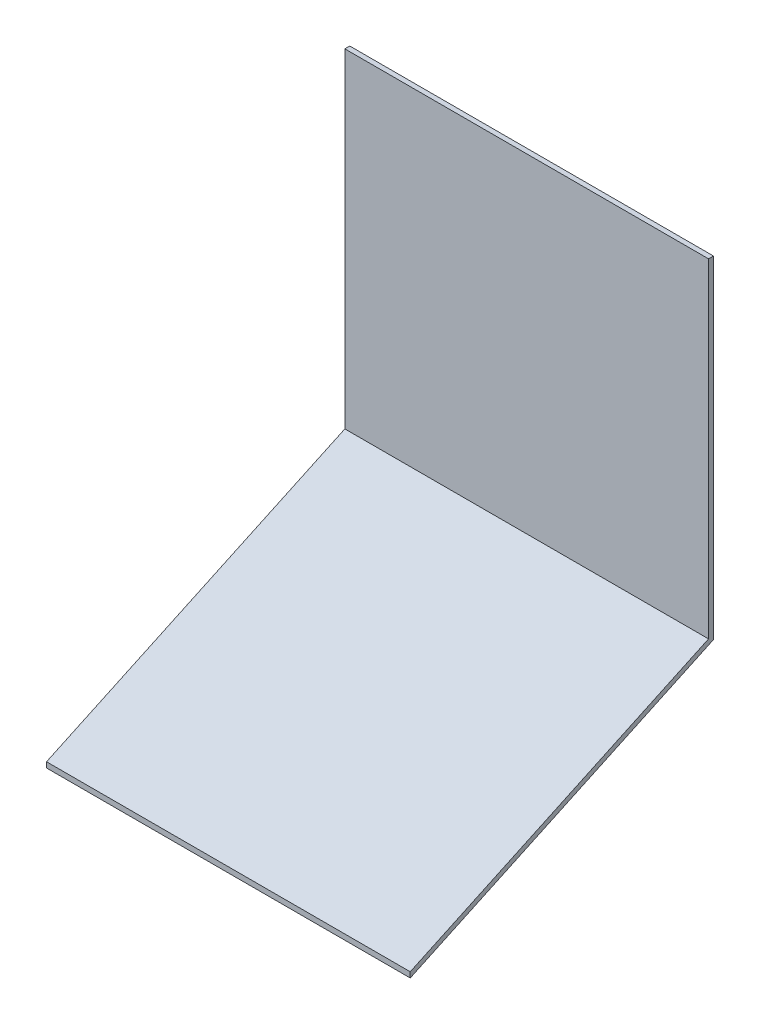
ISO-10303-21;
HEADER;
FILE_DESCRIPTION(('STEP AP214'),'2;1');
FILE_NAME('part.step','',(''),(''),'','','');
FILE_SCHEMA(('AUTOMOTIVE_DESIGN { 1 0 10303 214 1 1 1 1 }'));
ENDSEC;
DATA;
#1=APPLICATION_CONTEXT('core data for automotive mechanical design processes');
#2=APPLICATION_PROTOCOL_DEFINITION('international standard','automotive_design',2000,#1);
#3=PRODUCT_CONTEXT('',#1,'mechanical');
#4=PRODUCT('Part','Part','',(#3));
#5=PRODUCT_RELATED_PRODUCT_CATEGORY('part','',(#4));
#6=PRODUCT_DEFINITION_FORMATION('','',#4);
#7=PRODUCT_DEFINITION_CONTEXT('part definition',#1,'design');
#8=PRODUCT_DEFINITION('design','',#6,#7);
#9=PRODUCT_DEFINITION_SHAPE('','',#8);
#10=(LENGTH_UNIT() NAMED_UNIT(*) SI_UNIT(.MILLI.,.METRE.));
#11=(NAMED_UNIT(*) PLANE_ANGLE_UNIT() SI_UNIT($,.RADIAN.));
#12=(NAMED_UNIT(*) SI_UNIT($,.STERADIAN.) SOLID_ANGLE_UNIT());
#13=UNCERTAINTY_MEASURE_WITH_UNIT(LENGTH_MEASURE(1.E-05),#10,'distance_accuracy_value','');
#14=(GEOMETRIC_REPRESENTATION_CONTEXT(3) GLOBAL_UNCERTAINTY_ASSIGNED_CONTEXT((#13)) GLOBAL_UNIT_ASSIGNED_CONTEXT((#10,
#11,#12)) REPRESENTATION_CONTEXT('',''));
#15=CARTESIAN_POINT('',(0.,0.,0.));
#16=DIRECTION('',(0.,0.,1.));
#17=DIRECTION('',(1.,0.,0.));
#18=AXIS2_PLACEMENT_3D('',#15,#16,#17);
#19=CARTESIAN_POINT('',(112.268,-1.67594278867052,0.));
#20=DIRECTION('',(0.,0.,-1.));
#21=DIRECTION('',(0.,1.,0.));
#22=AXIS2_PLACEMENT_3D('',#19,#20,#21);
#23=PLANE('',#22);
#24=DIRECTION('',(0.,-1.,0.));
#25=VECTOR('',#24,1.);
#26=CARTESIAN_POINT('',(0.,-1.67594278867052,0.));
#27=LINE('',#26,#25);
#28=CARTESIAN_POINT('',(0.,0.,0.));
#29=VERTEX_POINT('',#28);
#30=CARTESIAN_POINT('',(0.,-1.67594278867052,0.));
#31=VERTEX_POINT('',#30);
#32=EDGE_CURVE('E127',#29,#31,#27,.T.);
#33=ORIENTED_EDGE('',*,*,#32,.T.);
#34=DIRECTION('',(-1.,0.,0.));
#35=VECTOR('',#34,1.);
#36=CARTESIAN_POINT('',(112.268,-1.67594278867052,0.));
#37=LINE('',#36,#35);
#38=CARTESIAN_POINT('',(112.268,-1.67594278867052,0.));
#39=VERTEX_POINT('',#38);
#40=EDGE_CURVE('E11',#39,#31,#37,.T.);
#41=ORIENTED_EDGE('',*,*,#40,.F.);
#42=DIRECTION('',(0.,-1.,0.));
#43=VECTOR('',#42,1.);
#44=CARTESIAN_POINT('',(112.268,-1.67594278867052,0.));
#45=LINE('',#44,#43);
#46=CARTESIAN_POINT('',(112.268,0.,0.));
#47=VERTEX_POINT('',#46);
#48=EDGE_CURVE('E143',#47,#39,#45,.T.);
#49=ORIENTED_EDGE('',*,*,#48,.F.);
#50=DIRECTION('',(-1.,0.,0.));
#51=VECTOR('',#50,1.);
#52=CARTESIAN_POINT('',(112.268,0.,0.));
#53=LINE('',#52,#51);
#54=EDGE_CURVE('E123',#47,#29,#53,.T.);
#55=ORIENTED_EDGE('',*,*,#54,.T.);
#56=EDGE_LOOP('',(#33,#41,#49,#55));
#57=FACE_BOUND('',#56,.T.);
#58=ADVANCED_FACE('F38',(#57),#23,.F.);
#59=CARTESIAN_POINT('',(112.268,41.9703566323091,-93.5997911629238));
#60=DIRECTION('',(0.,0.906307787036651,0.422618261740697));
#61=DIRECTION('',(0.,-0.422618261740697,0.906307787036651));
#62=AXIS2_PLACEMENT_3D('',#59,#60,#61);
#63=PLANE('',#62);
#64=DIRECTION('',(0.,0.422618261740697,-0.906307787036651));
#65=VECTOR('',#64,1.);
#66=CARTESIAN_POINT('',(0.,41.9703566323091,-93.5997911629238));
#67=LINE('',#66,#65);
#68=CARTESIAN_POINT('',(0.,41.9703566323091,-93.5997911629238));
#69=VERTEX_POINT('',#68);
#70=EDGE_CURVE('E131',#31,#69,#67,.T.);
#71=ORIENTED_EDGE('',*,*,#70,.T.);
#72=DIRECTION('',(-1.,0.,0.));
#73=VECTOR('',#72,1.);
#74=CARTESIAN_POINT('',(112.268,41.9703566323091,-93.5997911629238));
#75=LINE('',#74,#73);
#76=CARTESIAN_POINT('',(112.268,41.9703566323091,-93.5997911629238));
#77=VERTEX_POINT('',#76);
#78=EDGE_CURVE('E47',#77,#69,#75,.T.);
#79=ORIENTED_EDGE('',*,*,#78,.F.);
#80=DIRECTION('',(0.,0.422618261740697,-0.906307787036651));
#81=VECTOR('',#80,1.);
#82=CARTESIAN_POINT('',(112.268,41.9703566323091,-93.5997911629238));
#83=LINE('',#82,#81);
#84=EDGE_CURVE('E92',#39,#77,#83,.T.);
#85=ORIENTED_EDGE('',*,*,#84,.F.);
#86=ORIENTED_EDGE('',*,*,#40,.T.);
#87=EDGE_LOOP('',(#71,#79,#85,#86));
#88=FACE_BOUND('',#87,.T.);
#89=ADVANCED_FACE('F171',(#88),#63,.F.);
#90=CARTESIAN_POINT('',(112.268,144.538015392855,-93.5997911629237));
#91=DIRECTION('',(0.,0.,1.));
#92=DIRECTION('',(0.,-1.,0.));
#93=AXIS2_PLACEMENT_3D('',#90,#91,#92);
#94=PLANE('',#93);
#95=DIRECTION('',(0.,1.,0.));
#96=VECTOR('',#95,1.);
#97=CARTESIAN_POINT('',(0.,144.538015392855,-93.5997911629237));
#98=LINE('',#97,#96);
#99=CARTESIAN_POINT('',(0.,144.538015392855,-93.5997911629237));
#100=VERTEX_POINT('',#99);
#101=EDGE_CURVE('E134',#69,#100,#98,.T.);
#102=ORIENTED_EDGE('',*,*,#101,.T.);
#103=DIRECTION('',(-1.,0.,0.));
#104=VECTOR('',#103,1.);
#105=CARTESIAN_POINT('',(112.268,144.538015392855,-93.5997911629237));
#106=LINE('',#105,#104);
#107=CARTESIAN_POINT('',(112.268,144.538015392855,-93.5997911629237));
#108=VERTEX_POINT('',#107);
#109=EDGE_CURVE('E116',#108,#100,#106,.T.);
#110=ORIENTED_EDGE('',*,*,#109,.F.);
#111=DIRECTION('',(0.,1.,0.));
#112=VECTOR('',#111,1.);
#113=CARTESIAN_POINT('',(112.268,144.538015392855,-93.5997911629237));
#114=LINE('',#113,#112);
#115=EDGE_CURVE('E105',#77,#108,#114,.T.);
#116=ORIENTED_EDGE('',*,*,#115,.F.);
#117=ORIENTED_EDGE('',*,*,#78,.T.);
#118=EDGE_LOOP('',(#102,#110,#116,#117));
#119=FACE_BOUND('',#118,.T.);
#120=ADVANCED_FACE('F153',(#119),#94,.F.);
#121=CARTESIAN_POINT('',(112.268,144.538015392855,-92.0808711629237));
#122=DIRECTION('',(0.,-1.,0.));
#123=DIRECTION('',(0.,0.,-1.));
#124=AXIS2_PLACEMENT_3D('',#121,#122,#123);
#125=PLANE('',#124);
#126=DIRECTION('',(0.,0.,1.));
#127=VECTOR('',#126,1.);
#128=CARTESIAN_POINT('',(0.,144.538015392855,-92.0808711629237));
#129=LINE('',#128,#127);
#130=CARTESIAN_POINT('',(0.,144.538015392855,-92.0808711629237));
#131=VERTEX_POINT('',#130);
#132=EDGE_CURVE('E114',#100,#131,#129,.T.);
#133=ORIENTED_EDGE('',*,*,#132,.T.);
#134=DIRECTION('',(-1.,0.,0.));
#135=VECTOR('',#134,1.);
#136=CARTESIAN_POINT('',(112.268,144.538015392855,-92.0808711629237));
#137=LINE('',#136,#135);
#138=CARTESIAN_POINT('',(112.268,144.538015392855,-92.0808711629237));
#139=VERTEX_POINT('',#138);
#140=EDGE_CURVE('E111',#139,#131,#137,.T.);
#141=ORIENTED_EDGE('',*,*,#140,.F.);
#142=DIRECTION('',(0.,0.,1.));
#143=VECTOR('',#142,1.);
#144=CARTESIAN_POINT('',(112.268,144.538015392855,-92.0808711629237));
#145=LINE('',#144,#143);
#146=EDGE_CURVE('E99',#108,#139,#145,.T.);
#147=ORIENTED_EDGE('',*,*,#146,.F.);
#148=ORIENTED_EDGE('',*,*,#109,.T.);
#149=EDGE_LOOP('',(#133,#141,#147,#148));
#150=FACE_BOUND('',#149,.T.);
#151=ADVANCED_FACE('F112',(#150),#125,.F.);
#152=CARTESIAN_POINT('',(112.268,42.9380153928548,-92.0808711629237));
#153=DIRECTION('',(0.,0.,-1.));
#154=DIRECTION('',(0.,1.,0.));
#155=AXIS2_PLACEMENT_3D('',#152,#153,#154);
#156=PLANE('',#155);
#157=DIRECTION('',(0.,-1.,0.));
#158=VECTOR('',#157,1.);
#159=CARTESIAN_POINT('',(0.,42.9380153928548,-92.0808711629237));
#160=LINE('',#159,#158);
#161=CARTESIAN_POINT('',(0.,42.9380153928548,-92.0808711629237));
#162=VERTEX_POINT('',#161);
#163=EDGE_CURVE('E78',#131,#162,#160,.T.);
#164=ORIENTED_EDGE('',*,*,#163,.T.);
#165=DIRECTION('',(-1.,0.,0.));
#166=VECTOR('',#165,1.);
#167=CARTESIAN_POINT('',(112.268,42.9380153928548,-92.0808711629237));
#168=LINE('',#167,#166);
#169=CARTESIAN_POINT('',(112.268,42.9380153928548,-92.0808711629237));
#170=VERTEX_POINT('',#169);
#171=EDGE_CURVE('E117',#170,#162,#168,.T.);
#172=ORIENTED_EDGE('',*,*,#171,.F.);
#173=DIRECTION('',(0.,-1.,0.));
#174=VECTOR('',#173,1.);
#175=CARTESIAN_POINT('',(112.268,42.9380153928548,-92.0808711629237));
#176=LINE('',#175,#174);
#177=EDGE_CURVE('E103',#139,#170,#176,.T.);
#178=ORIENTED_EDGE('',*,*,#177,.F.);
#179=ORIENTED_EDGE('',*,*,#140,.T.);
#180=EDGE_LOOP('',(#164,#172,#178,#179));
#181=FACE_BOUND('',#180,.T.);
#182=ADVANCED_FACE('F119',(#181),#156,.F.);
#183=CARTESIAN_POINT('',(112.268,0.,0.));
#184=DIRECTION('',(0.,-0.906307787036651,-0.422618261740697));
#185=DIRECTION('',(0.,0.422618261740697,-0.906307787036651));
#186=AXIS2_PLACEMENT_3D('',#183,#184,#185);
#187=PLANE('',#186);
#188=DIRECTION('',(0.,-0.422618261740697,0.906307787036651));
#189=VECTOR('',#188,1.);
#190=CARTESIAN_POINT('',(0.,0.,0.));
#191=LINE('',#190,#189);
#192=EDGE_CURVE('E84',#162,#29,#191,.T.);
#193=ORIENTED_EDGE('',*,*,#192,.T.);
#194=ORIENTED_EDGE('',*,*,#54,.F.);
#195=DIRECTION('',(0.,-0.422618261740697,0.906307787036651));
#196=VECTOR('',#195,1.);
#197=CARTESIAN_POINT('',(112.268,0.,0.));
#198=LINE('',#197,#196);
#199=EDGE_CURVE('E55',#170,#47,#198,.T.);
#200=ORIENTED_EDGE('',*,*,#199,.F.);
#201=ORIENTED_EDGE('',*,*,#171,.T.);
#202=EDGE_LOOP('',(#193,#194,#200,#201));
#203=FACE_BOUND('',#202,.T.);
#204=ADVANCED_FACE('F160',(#203),#187,.F.);
#205=CARTESIAN_POINT('',(112.268,0.,0.));
#206=DIRECTION('',(-1.,0.,0.));
#207=DIRECTION('',(0.,0.,1.));
#208=AXIS2_PLACEMENT_3D('',#205,#206,#207);
#209=PLANE('',#208);
#210=ORIENTED_EDGE('',*,*,#48,.T.);
#211=ORIENTED_EDGE('',*,*,#84,.T.);
#212=ORIENTED_EDGE('',*,*,#115,.T.);
#213=ORIENTED_EDGE('',*,*,#146,.T.);
#214=ORIENTED_EDGE('',*,*,#177,.T.);
#215=ORIENTED_EDGE('',*,*,#199,.T.);
#216=EDGE_LOOP('',(#210,#211,#212,#213,#214,#215));
#217=FACE_BOUND('',#216,.T.);
#218=ADVANCED_FACE('F101',(#217),#209,.F.);
#219=CARTESIAN_POINT('',(0.,0.,0.));
#220=DIRECTION('',(-1.,0.,0.));
#221=DIRECTION('',(0.,0.,1.));
#222=AXIS2_PLACEMENT_3D('',#219,#220,#221);
#223=PLANE('',#222);
#224=ORIENTED_EDGE('',*,*,#32,.F.);
#225=ORIENTED_EDGE('',*,*,#192,.F.);
#226=ORIENTED_EDGE('',*,*,#163,.F.);
#227=ORIENTED_EDGE('',*,*,#132,.F.);
#228=ORIENTED_EDGE('',*,*,#101,.F.);
#229=ORIENTED_EDGE('',*,*,#70,.F.);
#230=EDGE_LOOP('',(#224,#225,#226,#227,#228,#229));
#231=FACE_BOUND('',#230,.T.);
#232=ADVANCED_FACE('F156',(#231),#223,.T.);
#233=CLOSED_SHELL('',(#58,#89,#120,#151,#182,#204,#218,#232));
#234=MANIFOLD_SOLID_BREP('B2',#233);
#235=ADVANCED_BREP_SHAPE_REPRESENTATION('',(#18,#234),#14);
#236=SHAPE_DEFINITION_REPRESENTATION(#9,#235);
ENDSEC;
END-ISO-10303-21;
